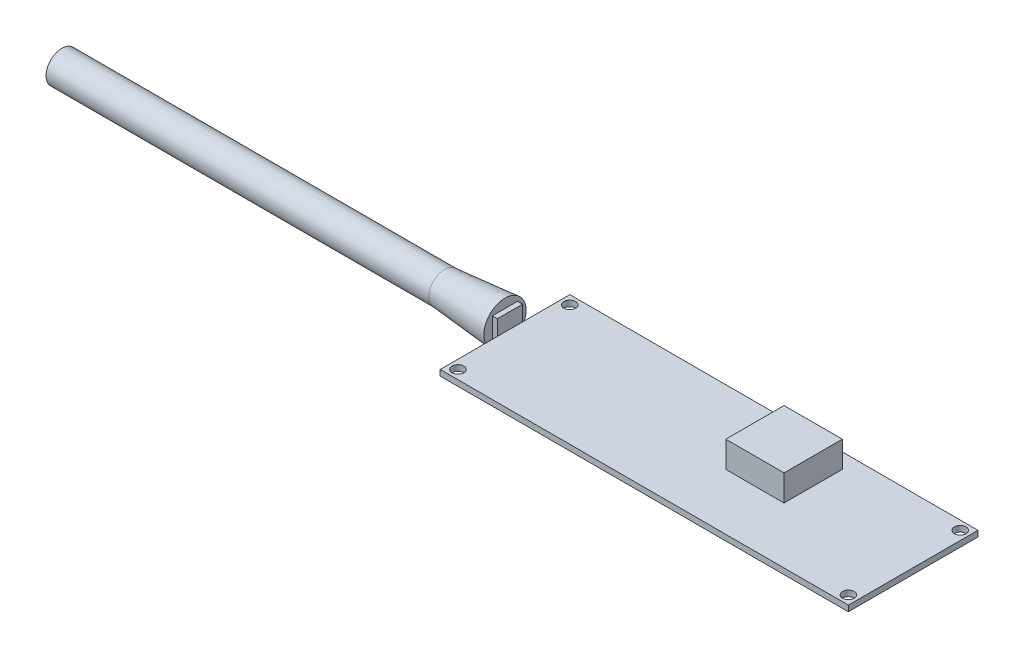
ISO-10303-21;
HEADER;
FILE_DESCRIPTION(('STEP AP214'),'2;1');
FILE_NAME('part.step','',(''),(''),'','','');
FILE_SCHEMA(('AUTOMOTIVE_DESIGN { 1 0 10303 214 1 1 1 1 }'));
ENDSEC;
DATA;
#1=APPLICATION_CONTEXT('core data for automotive mechanical design processes');
#2=APPLICATION_PROTOCOL_DEFINITION('international standard','automotive_design',2000,#1);
#3=PRODUCT_CONTEXT('',#1,'mechanical');
#4=PRODUCT('Part','Part','',(#3));
#5=PRODUCT_RELATED_PRODUCT_CATEGORY('part','',(#4));
#6=PRODUCT_DEFINITION_FORMATION('','',#4);
#7=PRODUCT_DEFINITION_CONTEXT('part definition',#1,'design');
#8=PRODUCT_DEFINITION('design','',#6,#7);
#9=PRODUCT_DEFINITION_SHAPE('','',#8);
#10=(LENGTH_UNIT() NAMED_UNIT(*) SI_UNIT(.MILLI.,.METRE.));
#11=(NAMED_UNIT(*) PLANE_ANGLE_UNIT() SI_UNIT($,.RADIAN.));
#12=(NAMED_UNIT(*) SI_UNIT($,.STERADIAN.) SOLID_ANGLE_UNIT());
#13=UNCERTAINTY_MEASURE_WITH_UNIT(LENGTH_MEASURE(1.E-05),#10,'distance_accuracy_value','');
#14=(GEOMETRIC_REPRESENTATION_CONTEXT(3) GLOBAL_UNCERTAINTY_ASSIGNED_CONTEXT((#13)) GLOBAL_UNIT_ASSIGNED_CONTEXT((#10,
#11,#12)) REPRESENTATION_CONTEXT('',''));
#15=CARTESIAN_POINT('',(0.,0.,0.));
#16=DIRECTION('',(0.,0.,1.));
#17=DIRECTION('',(1.,0.,0.));
#18=AXIS2_PLACEMENT_3D('',#15,#16,#17);
#19=CARTESIAN_POINT('',(-51.5874,1.4605,16.383));
#20=DIRECTION('',(1.,0.,0.));
#21=DIRECTION('',(0.,0.,-1.));
#22=AXIS2_PLACEMENT_3D('',#19,#20,#21);
#23=PLANE('',#22);
#24=DIRECTION('',(0.,1.,0.));
#25=VECTOR('',#24,1.);
#26=CARTESIAN_POINT('',(-51.5874,-0.762,1.905));
#27=LINE('',#26,#25);
#28=CARTESIAN_POINT('',(-51.5874,0.,1.905));
#29=VERTEX_POINT('',#28);
#30=CARTESIAN_POINT('',(-51.5874,1.4605,1.905));
#31=VERTEX_POINT('',#30);
#32=EDGE_CURVE('E11',#29,#31,#27,.T.);
#33=ORIENTED_EDGE('',*,*,#32,.F.);
#34=DIRECTION('',(0.,0.,1.));
#35=VECTOR('',#34,1.);
#36=CARTESIAN_POINT('',(-51.5874,0.,16.383));
#37=LINE('',#36,#35);
#38=CARTESIAN_POINT('',(-51.5874,0.,16.383));
#39=VERTEX_POINT('',#38);
#40=EDGE_CURVE('E262',#29,#39,#37,.T.);
#41=ORIENTED_EDGE('',*,*,#40,.T.);
#42=DIRECTION('',(0.,-1.,0.));
#43=VECTOR('',#42,1.);
#44=CARTESIAN_POINT('',(-51.5874,1.4605,16.383));
#45=LINE('',#44,#43);
#46=CARTESIAN_POINT('',(-51.5874,1.4605,16.383));
#47=VERTEX_POINT('',#46);
#48=EDGE_CURVE('E269',#47,#39,#45,.T.);
#49=ORIENTED_EDGE('',*,*,#48,.F.);
#50=DIRECTION('',(0.,0.,1.));
#51=VECTOR('',#50,1.);
#52=CARTESIAN_POINT('',(-51.5874,1.4605,16.383));
#53=LINE('',#52,#51);
#54=EDGE_CURVE('E59',#31,#47,#53,.T.);
#55=ORIENTED_EDGE('',*,*,#54,.F.);
#56=EDGE_LOOP('',(#33,#41,#49,#55));
#57=FACE_BOUND('',#56,.T.);
#58=ADVANCED_FACE('F38',(#57),#23,.F.);
#59=DIRECTION('',(0.,-1.,0.));
#60=VECTOR('',#59,1.);
#61=CARTESIAN_POINT('',(-51.5874,-0.762,-4.445));
#62=LINE('',#61,#60);
#63=CARTESIAN_POINT('',(-51.5874,1.4605,-4.445));
#64=VERTEX_POINT('',#63);
#65=CARTESIAN_POINT('',(-51.5874,0.,-4.445));
#66=VERTEX_POINT('',#65);
#67=EDGE_CURVE('E49',#64,#66,#62,.T.);
#68=ORIENTED_EDGE('',*,*,#67,.F.);
#69=CARTESIAN_POINT('',(-51.5874,1.4605,-16.383));
#70=VERTEX_POINT('',#69);
#71=EDGE_CURVE('E252',#70,#64,#53,.T.);
#72=ORIENTED_EDGE('',*,*,#71,.F.);
#73=DIRECTION('',(0.,-1.,0.));
#74=VECTOR('',#73,1.);
#75=CARTESIAN_POINT('',(-51.5874,1.4605,-16.383));
#76=LINE('',#75,#74);
#77=CARTESIAN_POINT('',(-51.5874,0.,-16.383));
#78=VERTEX_POINT('',#77);
#79=EDGE_CURVE('E272',#70,#78,#76,.T.);
#80=ORIENTED_EDGE('',*,*,#79,.T.);
#81=EDGE_CURVE('E263',#78,#66,#37,.T.);
#82=ORIENTED_EDGE('',*,*,#81,.T.);
#83=EDGE_LOOP('',(#68,#72,#80,#82));
#84=FACE_BOUND('',#83,.T.);
#85=ADVANCED_FACE('F342',(#84),#23,.F.);
#86=CARTESIAN_POINT('',(0.,1.4605,0.));
#87=DIRECTION('',(0.,-1.,0.));
#88=DIRECTION('',(0.,0.,-1.));
#89=AXIS2_PLACEMENT_3D('',#86,#87,#88);
#90=PLANE('',#89);
#91=DIRECTION('',(0.,0.,-1.));
#92=VECTOR('',#91,1.);
#93=CARTESIAN_POINT('',(51.5874,1.4605,16.383));
#94=LINE('',#93,#92);
#95=CARTESIAN_POINT('',(51.5874,1.4605,16.383));
#96=VERTEX_POINT('',#95);
#97=CARTESIAN_POINT('',(51.5874,1.4605,-16.383));
#98=VERTEX_POINT('',#97);
#99=EDGE_CURVE('E246',#96,#98,#94,.T.);
#100=ORIENTED_EDGE('',*,*,#99,.T.);
#101=DIRECTION('',(-1.,0.,0.));
#102=VECTOR('',#101,1.);
#103=CARTESIAN_POINT('',(-51.5874,1.4605,-16.383));
#104=LINE('',#103,#102);
#105=EDGE_CURVE('E249',#98,#70,#104,.T.);
#106=ORIENTED_EDGE('',*,*,#105,.T.);
#107=ORIENTED_EDGE('',*,*,#71,.T.);
#108=EDGE_CURVE('E255',#64,#31,#53,.T.);
#109=ORIENTED_EDGE('',*,*,#108,.T.);
#110=ORIENTED_EDGE('',*,*,#54,.T.);
#111=DIRECTION('',(1.,0.,0.));
#112=VECTOR('',#111,1.);
#113=CARTESIAN_POINT('',(-51.5874,1.4605,16.383));
#114=LINE('',#113,#112);
#115=EDGE_CURVE('E254',#47,#96,#114,.T.);
#116=ORIENTED_EDGE('',*,*,#115,.T.);
#117=EDGE_LOOP('',(#100,#106,#107,#109,#110,#116));
#118=FACE_BOUND('',#117,.T.);
#119=CARTESIAN_POINT('',(-49.3395,1.4605,-14.1351));
#120=DIRECTION('',(0.,1.,0.));
#121=DIRECTION('',(0.,0.,1.));
#122=AXIS2_PLACEMENT_3D('',#119,#120,#121);
#123=CIRCLE('',#122,1.4859);
#124=CARTESIAN_POINT('',(-49.3395,1.4605,-12.6492));
#125=VERTEX_POINT('',#124);
#126=EDGE_CURVE('E229',#125,#125,#123,.T.);
#127=ORIENTED_EDGE('',*,*,#126,.F.);
#128=EDGE_LOOP('',(#127));
#129=FACE_BOUND('',#128,.T.);
#130=CARTESIAN_POINT('',(49.3395,1.4605,-14.1351));
#131=DIRECTION('',(0.,1.,0.));
#132=DIRECTION('',(0.,0.,1.));
#133=AXIS2_PLACEMENT_3D('',#130,#131,#132);
#134=CIRCLE('',#133,1.4859);
#135=CARTESIAN_POINT('',(49.3395,1.4605,-12.6492));
#136=VERTEX_POINT('',#135);
#137=EDGE_CURVE('E222',#136,#136,#134,.T.);
#138=ORIENTED_EDGE('',*,*,#137,.F.);
#139=EDGE_LOOP('',(#138));
#140=FACE_BOUND('',#139,.T.);
#141=CARTESIAN_POINT('',(49.3395,1.4605,14.1351));
#142=DIRECTION('',(0.,1.,0.));
#143=DIRECTION('',(0.,0.,1.));
#144=AXIS2_PLACEMENT_3D('',#141,#142,#143);
#145=CIRCLE('',#144,1.4859);
#146=CARTESIAN_POINT('',(49.3395,1.4605,15.621));
#147=VERTEX_POINT('',#146);
#148=EDGE_CURVE('E230',#147,#147,#145,.T.);
#149=ORIENTED_EDGE('',*,*,#148,.F.);
#150=EDGE_LOOP('',(#149));
#151=FACE_BOUND('',#150,.T.);
#152=CARTESIAN_POINT('',(-49.3395,1.4605,14.1351));
#153=DIRECTION('',(0.,1.,0.));
#154=DIRECTION('',(0.,0.,1.));
#155=AXIS2_PLACEMENT_3D('',#152,#153,#154);
#156=CIRCLE('',#155,1.4859);
#157=CARTESIAN_POINT('',(-49.3395,1.4605,15.621));
#158=VERTEX_POINT('',#157);
#159=EDGE_CURVE('E221',#158,#158,#156,.T.);
#160=ORIENTED_EDGE('',*,*,#159,.F.);
#161=EDGE_LOOP('',(#160));
#162=FACE_BOUND('',#161,.T.);
#163=DIRECTION('',(0.,0.,-1.));
#164=VECTOR('',#163,1.);
#165=CARTESIAN_POINT('',(21.1074,1.4605,-12.573));
#166=LINE('',#165,#164);
#167=CARTESIAN_POINT('',(21.1074,1.4605,2.159));
#168=VERTEX_POINT('',#167);
#169=CARTESIAN_POINT('',(21.1074,1.4605,-12.573));
#170=VERTEX_POINT('',#169);
#171=EDGE_CURVE('E188',#168,#170,#166,.T.);
#172=ORIENTED_EDGE('',*,*,#171,.F.);
#173=DIRECTION('',(1.,0.,0.));
#174=VECTOR('',#173,1.);
#175=CARTESIAN_POINT('',(6.37540000000003,1.4605,2.159));
#176=LINE('',#175,#174);
#177=CARTESIAN_POINT('',(6.37540000000003,1.4605,2.159));
#178=VERTEX_POINT('',#177);
#179=EDGE_CURVE('E193',#178,#168,#176,.T.);
#180=ORIENTED_EDGE('',*,*,#179,.F.);
#181=DIRECTION('',(0.,0.,1.));
#182=VECTOR('',#181,1.);
#183=CARTESIAN_POINT('',(6.37540000000002,1.4605,-12.573));
#184=LINE('',#183,#182);
#185=CARTESIAN_POINT('',(6.37540000000002,1.4605,-12.573));
#186=VERTEX_POINT('',#185);
#187=EDGE_CURVE('E205',#186,#178,#184,.T.);
#188=ORIENTED_EDGE('',*,*,#187,.F.);
#189=DIRECTION('',(-1.,0.,0.));
#190=VECTOR('',#189,1.);
#191=CARTESIAN_POINT('',(6.37540000000002,1.4605,-12.573));
#192=LINE('',#191,#190);
#193=EDGE_CURVE('E202',#170,#186,#192,.T.);
#194=ORIENTED_EDGE('',*,*,#193,.F.);
#195=EDGE_LOOP('',(#172,#180,#188,#194));
#196=FACE_BOUND('',#195,.T.);
#197=ADVANCED_FACE('F322',(#118,#129,#140,#151,#162,#196),#90,.F.);
#198=CARTESIAN_POINT('',(51.5874,1.4605,16.383));
#199=DIRECTION('',(-1.,0.,0.));
#200=DIRECTION('',(0.,0.,1.));
#201=AXIS2_PLACEMENT_3D('',#198,#199,#200);
#202=PLANE('',#201);
#203=DIRECTION('',(0.,0.,-1.));
#204=VECTOR('',#203,1.);
#205=CARTESIAN_POINT('',(51.5874,0.,16.383));
#206=LINE('',#205,#204);
#207=CARTESIAN_POINT('',(51.5874,0.,16.383));
#208=VERTEX_POINT('',#207);
#209=CARTESIAN_POINT('',(51.5874,0.,-16.383));
#210=VERTEX_POINT('',#209);
#211=EDGE_CURVE('E245',#208,#210,#206,.T.);
#212=ORIENTED_EDGE('',*,*,#211,.T.);
#213=DIRECTION('',(0.,-1.,0.));
#214=VECTOR('',#213,1.);
#215=CARTESIAN_POINT('',(51.5874,1.4605,-16.383));
#216=LINE('',#215,#214);
#217=EDGE_CURVE('E275',#98,#210,#216,.T.);
#218=ORIENTED_EDGE('',*,*,#217,.F.);
#219=ORIENTED_EDGE('',*,*,#99,.F.);
#220=DIRECTION('',(0.,-1.,0.));
#221=VECTOR('',#220,1.);
#222=CARTESIAN_POINT('',(51.5874,1.4605,16.383));
#223=LINE('',#222,#221);
#224=EDGE_CURVE('E257',#96,#208,#223,.T.);
#225=ORIENTED_EDGE('',*,*,#224,.T.);
#226=EDGE_LOOP('',(#212,#218,#219,#225));
#227=FACE_BOUND('',#226,.T.);
#228=ADVANCED_FACE('F40',(#227),#202,.F.);
#229=CARTESIAN_POINT('',(-51.5874,1.4605,-16.383));
#230=DIRECTION('',(0.,0.,1.));
#231=DIRECTION('',(1.,0.,0.));
#232=AXIS2_PLACEMENT_3D('',#229,#230,#231);
#233=PLANE('',#232);
#234=DIRECTION('',(-1.,0.,0.));
#235=VECTOR('',#234,1.);
#236=CARTESIAN_POINT('',(-51.5874,0.,-16.383));
#237=LINE('',#236,#235);
#238=EDGE_CURVE('E260',#210,#78,#237,.T.);
#239=ORIENTED_EDGE('',*,*,#238,.T.);
#240=ORIENTED_EDGE('',*,*,#79,.F.);
#241=ORIENTED_EDGE('',*,*,#105,.F.);
#242=ORIENTED_EDGE('',*,*,#217,.T.);
#243=EDGE_LOOP('',(#239,#240,#241,#242));
#244=FACE_BOUND('',#243,.T.);
#245=ADVANCED_FACE('F349',(#244),#233,.F.);
#246=CARTESIAN_POINT('',(-51.5874,1.4605,16.383));
#247=DIRECTION('',(0.,0.,-1.));
#248=DIRECTION('',(-1.,0.,0.));
#249=AXIS2_PLACEMENT_3D('',#246,#247,#248);
#250=PLANE('',#249);
#251=DIRECTION('',(1.,0.,0.));
#252=VECTOR('',#251,1.);
#253=CARTESIAN_POINT('',(-51.5874,0.,16.383));
#254=LINE('',#253,#252);
#255=EDGE_CURVE('E250',#39,#208,#254,.T.);
#256=ORIENTED_EDGE('',*,*,#255,.T.);
#257=ORIENTED_EDGE('',*,*,#224,.F.);
#258=ORIENTED_EDGE('',*,*,#115,.F.);
#259=ORIENTED_EDGE('',*,*,#48,.T.);
#260=EDGE_LOOP('',(#256,#257,#258,#259));
#261=FACE_BOUND('',#260,.T.);
#262=ADVANCED_FACE('F316',(#261),#250,.F.);
#263=CARTESIAN_POINT('',(0.,0.,0.));
#264=DIRECTION('',(0.,-1.,0.));
#265=DIRECTION('',(0.,0.,-1.));
#266=AXIS2_PLACEMENT_3D('',#263,#264,#265);
#267=PLANE('',#266);
#268=CARTESIAN_POINT('',(-49.3395,0.,14.1351));
#269=DIRECTION('',(0.,-1.,0.));
#270=DIRECTION('',(0.,0.,-1.));
#271=AXIS2_PLACEMENT_3D('',#268,#269,#270);
#272=CIRCLE('',#271,1.4859);
#273=CARTESIAN_POINT('',(-49.3395,0.,12.6492));
#274=VERTEX_POINT('',#273);
#275=EDGE_CURVE('E233',#274,#274,#272,.F.);
#276=ORIENTED_EDGE('',*,*,#275,.T.);
#277=EDGE_LOOP('',(#276));
#278=FACE_BOUND('',#277,.T.);
#279=CARTESIAN_POINT('',(49.3395,0.,14.1351));
#280=DIRECTION('',(0.,-1.,0.));
#281=DIRECTION('',(0.,0.,-1.));
#282=AXIS2_PLACEMENT_3D('',#279,#280,#281);
#283=CIRCLE('',#282,1.4859);
#284=CARTESIAN_POINT('',(49.3395,0.,12.6492));
#285=VERTEX_POINT('',#284);
#286=EDGE_CURVE('E226',#285,#285,#283,.F.);
#287=ORIENTED_EDGE('',*,*,#286,.T.);
#288=EDGE_LOOP('',(#287));
#289=FACE_BOUND('',#288,.T.);
#290=CARTESIAN_POINT('',(49.3395,0.,-14.1351));
#291=DIRECTION('',(0.,-1.,0.));
#292=DIRECTION('',(0.,0.,-1.));
#293=AXIS2_PLACEMENT_3D('',#290,#291,#292);
#294=CIRCLE('',#293,1.4859);
#295=CARTESIAN_POINT('',(49.3395,0.,-15.621));
#296=VERTEX_POINT('',#295);
#297=EDGE_CURVE('E225',#296,#296,#294,.F.);
#298=ORIENTED_EDGE('',*,*,#297,.T.);
#299=EDGE_LOOP('',(#298));
#300=FACE_BOUND('',#299,.T.);
#301=CARTESIAN_POINT('',(-49.3395,0.,-14.1351));
#302=DIRECTION('',(0.,-1.,0.));
#303=DIRECTION('',(0.,0.,-1.));
#304=AXIS2_PLACEMENT_3D('',#301,#302,#303);
#305=CIRCLE('',#304,1.4859);
#306=CARTESIAN_POINT('',(-49.3395,0.,-15.621));
#307=VERTEX_POINT('',#306);
#308=EDGE_CURVE('E242',#307,#307,#305,.F.);
#309=ORIENTED_EDGE('',*,*,#308,.T.);
#310=EDGE_LOOP('',(#309));
#311=FACE_BOUND('',#310,.T.);
#312=ORIENTED_EDGE('',*,*,#211,.F.);
#313=ORIENTED_EDGE('',*,*,#255,.F.);
#314=ORIENTED_EDGE('',*,*,#40,.F.);
#315=EDGE_CURVE('E265',#66,#29,#37,.T.);
#316=ORIENTED_EDGE('',*,*,#315,.F.);
#317=ORIENTED_EDGE('',*,*,#81,.F.);
#318=ORIENTED_EDGE('',*,*,#238,.F.);
#319=EDGE_LOOP('',(#312,#313,#314,#316,#317,#318));
#320=FACE_BOUND('',#319,.T.);
#321=ADVANCED_FACE('F312',(#278,#289,#300,#311,#320),#267,.T.);
#322=CARTESIAN_POINT('',(-49.3395,-4.20275986466036,-14.1351));
#323=DIRECTION('',(0.,1.,0.));
#324=DIRECTION('',(0.,0.,1.));
#325=AXIS2_PLACEMENT_3D('',#322,#323,#324);
#326=CYLINDRICAL_SURFACE('',#325,1.4859);
#327=ORIENTED_EDGE('',*,*,#126,.T.);
#328=EDGE_LOOP('',(#327));
#329=FACE_BOUND('',#328,.T.);
#330=ORIENTED_EDGE('',*,*,#308,.F.);
#331=EDGE_LOOP('',(#330));
#332=FACE_BOUND('',#331,.T.);
#333=ADVANCED_FACE('F363',(#329,#332),#326,.F.);
#334=CARTESIAN_POINT('',(49.3395,-4.20275986466036,-14.1351));
#335=DIRECTION('',(0.,1.,0.));
#336=DIRECTION('',(0.,0.,1.));
#337=AXIS2_PLACEMENT_3D('',#334,#335,#336);
#338=CYLINDRICAL_SURFACE('',#337,1.4859);
#339=ORIENTED_EDGE('',*,*,#137,.T.);
#340=EDGE_LOOP('',(#339));
#341=FACE_BOUND('',#340,.T.);
#342=ORIENTED_EDGE('',*,*,#297,.F.);
#343=EDGE_LOOP('',(#342));
#344=FACE_BOUND('',#343,.T.);
#345=ADVANCED_FACE('F370',(#341,#344),#338,.F.);
#346=CARTESIAN_POINT('',(49.3395,-4.20275986466036,14.1351));
#347=DIRECTION('',(0.,1.,0.));
#348=DIRECTION('',(0.,0.,1.));
#349=AXIS2_PLACEMENT_3D('',#346,#347,#348);
#350=CYLINDRICAL_SURFACE('',#349,1.4859);
#351=ORIENTED_EDGE('',*,*,#148,.T.);
#352=EDGE_LOOP('',(#351));
#353=FACE_BOUND('',#352,.T.);
#354=ORIENTED_EDGE('',*,*,#286,.F.);
#355=EDGE_LOOP('',(#354));
#356=FACE_BOUND('',#355,.T.);
#357=ADVANCED_FACE('F382',(#353,#356),#350,.F.);
#358=CARTESIAN_POINT('',(-49.3395,-4.20275986466036,14.1351));
#359=DIRECTION('',(0.,1.,0.));
#360=DIRECTION('',(0.,0.,1.));
#361=AXIS2_PLACEMENT_3D('',#358,#359,#360);
#362=CYLINDRICAL_SURFACE('',#361,1.4859);
#363=ORIENTED_EDGE('',*,*,#159,.T.);
#364=EDGE_LOOP('',(#363));
#365=FACE_BOUND('',#364,.T.);
#366=ORIENTED_EDGE('',*,*,#275,.F.);
#367=EDGE_LOOP('',(#366));
#368=FACE_BOUND('',#367,.T.);
#369=ADVANCED_FACE('F388',(#365,#368),#362,.F.);
#370=CARTESIAN_POINT('',(21.1074,8.0645,-12.573));
#371=DIRECTION('',(-1.,0.,0.));
#372=DIRECTION('',(0.,0.,1.));
#373=AXIS2_PLACEMENT_3D('',#370,#371,#372);
#374=PLANE('',#373);
#375=ORIENTED_EDGE('',*,*,#171,.T.);
#376=DIRECTION('',(0.,-1.,0.));
#377=VECTOR('',#376,1.);
#378=CARTESIAN_POINT('',(21.1074,8.0645,-12.573));
#379=LINE('',#378,#377);
#380=CARTESIAN_POINT('',(21.1074,8.0645,-12.573));
#381=VERTEX_POINT('',#380);
#382=EDGE_CURVE('E218',#381,#170,#379,.T.);
#383=ORIENTED_EDGE('',*,*,#382,.F.);
#384=DIRECTION('',(0.,0.,-1.));
#385=VECTOR('',#384,1.);
#386=CARTESIAN_POINT('',(21.1074,8.0645,-12.573));
#387=LINE('',#386,#385);
#388=CARTESIAN_POINT('',(21.1074,8.0645,2.159));
#389=VERTEX_POINT('',#388);
#390=EDGE_CURVE('E189',#389,#381,#387,.T.);
#391=ORIENTED_EDGE('',*,*,#390,.F.);
#392=DIRECTION('',(0.,-1.,0.));
#393=VECTOR('',#392,1.);
#394=CARTESIAN_POINT('',(21.1074,8.0645,2.159));
#395=LINE('',#394,#393);
#396=EDGE_CURVE('E199',#389,#168,#395,.T.);
#397=ORIENTED_EDGE('',*,*,#396,.T.);
#398=EDGE_LOOP('',(#375,#383,#391,#397));
#399=FACE_BOUND('',#398,.T.);
#400=ADVANCED_FACE('F392',(#399),#374,.F.);
#401=CARTESIAN_POINT('',(6.37540000000002,8.0645,-12.573));
#402=DIRECTION('',(0.,0.,1.));
#403=DIRECTION('',(1.,0.,0.));
#404=AXIS2_PLACEMENT_3D('',#401,#402,#403);
#405=PLANE('',#404);
#406=ORIENTED_EDGE('',*,*,#193,.T.);
#407=DIRECTION('',(0.,-1.,0.));
#408=VECTOR('',#407,1.);
#409=CARTESIAN_POINT('',(6.37540000000002,8.0645,-12.573));
#410=LINE('',#409,#408);
#411=CARTESIAN_POINT('',(6.37540000000002,8.0645,-12.573));
#412=VERTEX_POINT('',#411);
#413=EDGE_CURVE('E215',#412,#186,#410,.T.);
#414=ORIENTED_EDGE('',*,*,#413,.F.);
#415=DIRECTION('',(-1.,0.,0.));
#416=VECTOR('',#415,1.);
#417=CARTESIAN_POINT('',(6.37540000000002,8.0645,-12.573));
#418=LINE('',#417,#416);
#419=EDGE_CURVE('E192',#381,#412,#418,.T.);
#420=ORIENTED_EDGE('',*,*,#419,.F.);
#421=ORIENTED_EDGE('',*,*,#382,.T.);
#422=EDGE_LOOP('',(#406,#414,#420,#421));
#423=FACE_BOUND('',#422,.T.);
#424=ADVANCED_FACE('F399',(#423),#405,.F.);
#425=CARTESIAN_POINT('',(6.37540000000002,8.0645,-12.573));
#426=DIRECTION('',(1.,0.,0.));
#427=DIRECTION('',(0.,0.,-1.));
#428=AXIS2_PLACEMENT_3D('',#425,#426,#427);
#429=PLANE('',#428);
#430=ORIENTED_EDGE('',*,*,#187,.T.);
#431=DIRECTION('',(0.,-1.,0.));
#432=VECTOR('',#431,1.);
#433=CARTESIAN_POINT('',(6.37540000000003,8.0645,2.159));
#434=LINE('',#433,#432);
#435=CARTESIAN_POINT('',(6.37540000000003,8.0645,2.159));
#436=VERTEX_POINT('',#435);
#437=EDGE_CURVE('E212',#436,#178,#434,.T.);
#438=ORIENTED_EDGE('',*,*,#437,.F.);
#439=DIRECTION('',(0.,0.,1.));
#440=VECTOR('',#439,1.);
#441=CARTESIAN_POINT('',(6.37540000000002,8.0645,-12.573));
#442=LINE('',#441,#440);
#443=EDGE_CURVE('E195',#412,#436,#442,.T.);
#444=ORIENTED_EDGE('',*,*,#443,.F.);
#445=ORIENTED_EDGE('',*,*,#413,.T.);
#446=EDGE_LOOP('',(#430,#438,#444,#445));
#447=FACE_BOUND('',#446,.T.);
#448=ADVANCED_FACE('F414',(#447),#429,.F.);
#449=CARTESIAN_POINT('',(6.37540000000003,8.0645,2.159));
#450=DIRECTION('',(0.,0.,-1.));
#451=DIRECTION('',(-1.,0.,0.));
#452=AXIS2_PLACEMENT_3D('',#449,#450,#451);
#453=PLANE('',#452);
#454=ORIENTED_EDGE('',*,*,#179,.T.);
#455=ORIENTED_EDGE('',*,*,#396,.F.);
#456=DIRECTION('',(1.,0.,0.));
#457=VECTOR('',#456,1.);
#458=CARTESIAN_POINT('',(6.37540000000003,8.0645,2.159));
#459=LINE('',#458,#457);
#460=EDGE_CURVE('E197',#436,#389,#459,.T.);
#461=ORIENTED_EDGE('',*,*,#460,.F.);
#462=ORIENTED_EDGE('',*,*,#437,.T.);
#463=EDGE_LOOP('',(#454,#455,#461,#462));
#464=FACE_BOUND('',#463,.T.);
#465=ADVANCED_FACE('F336',(#464),#453,.F.);
#466=CARTESIAN_POINT('',(0.,8.0645,0.));
#467=DIRECTION('',(0.,1.,0.));
#468=DIRECTION('',(0.,0.,1.));
#469=AXIS2_PLACEMENT_3D('',#466,#467,#468);
#470=PLANE('',#469);
#471=ORIENTED_EDGE('',*,*,#390,.T.);
#472=ORIENTED_EDGE('',*,*,#419,.T.);
#473=ORIENTED_EDGE('',*,*,#443,.T.);
#474=ORIENTED_EDGE('',*,*,#460,.T.);
#475=EDGE_LOOP('',(#471,#472,#473,#474));
#476=FACE_BOUND('',#475,.T.);
#477=ADVANCED_FACE('F329',(#476),#470,.T.);
#478=CARTESIAN_POINT('',(-51.5874,0.,0.));
#479=DIRECTION('',(1.,0.,0.));
#480=DIRECTION('',(0.,0.,-1.));
#481=AXIS2_PLACEMENT_3D('',#478,#479,#480);
#482=PLANE('',#481);
#483=ORIENTED_EDGE('',*,*,#108,.F.);
#484=CARTESIAN_POINT('',(-51.5874,5.334,-4.445));
#485=VERTEX_POINT('',#484);
#486=EDGE_CURVE('E179',#485,#64,#62,.T.);
#487=ORIENTED_EDGE('',*,*,#486,.F.);
#488=DIRECTION('',(0.,0.,-1.));
#489=VECTOR('',#488,1.);
#490=CARTESIAN_POINT('',(-51.5874,5.334,-4.445));
#491=LINE('',#490,#489);
#492=CARTESIAN_POINT('',(-51.5874,5.334,1.905));
#493=VERTEX_POINT('',#492);
#494=EDGE_CURVE('E176',#493,#485,#491,.T.);
#495=ORIENTED_EDGE('',*,*,#494,.F.);
#496=EDGE_CURVE('E52',#31,#493,#27,.T.);
#497=ORIENTED_EDGE('',*,*,#496,.F.);
#498=EDGE_LOOP('',(#483,#487,#495,#497));
#499=FACE_BOUND('',#498,.T.);
#500=ADVANCED_FACE('F327',(#499),#482,.T.);
#501=CARTESIAN_POINT('',(-52.8574,-0.762,1.905));
#502=DIRECTION('',(0.,0.,-1.));
#503=DIRECTION('',(-1.,0.,0.));
#504=AXIS2_PLACEMENT_3D('',#501,#502,#503);
#505=PLANE('',#504);
#506=CARTESIAN_POINT('',(-51.5874,-0.762,1.905));
#507=VERTEX_POINT('',#506);
#508=EDGE_CURVE('E51',#507,#29,#27,.T.);
#509=ORIENTED_EDGE('',*,*,#508,.T.);
#510=ORIENTED_EDGE('',*,*,#32,.T.);
#511=ORIENTED_EDGE('',*,*,#496,.T.);
#512=DIRECTION('',(1.,0.,0.));
#513=VECTOR('',#512,1.);
#514=CARTESIAN_POINT('',(-52.8574,5.334,1.905));
#515=LINE('',#514,#513);
#516=CARTESIAN_POINT('',(-52.8574,5.334,1.905));
#517=VERTEX_POINT('',#516);
#518=EDGE_CURVE('E153',#517,#493,#515,.T.);
#519=ORIENTED_EDGE('',*,*,#518,.F.);
#520=DIRECTION('',(0.,1.,0.));
#521=VECTOR('',#520,1.);
#522=CARTESIAN_POINT('',(-52.8574,-0.762,1.905));
#523=LINE('',#522,#521);
#524=CARTESIAN_POINT('',(-52.8574,-0.762,1.905));
#525=VERTEX_POINT('',#524);
#526=EDGE_CURVE('E146',#525,#517,#523,.T.);
#527=ORIENTED_EDGE('',*,*,#526,.F.);
#528=DIRECTION('',(1.,0.,0.));
#529=VECTOR('',#528,1.);
#530=CARTESIAN_POINT('',(-52.8574,-0.762,1.905));
#531=LINE('',#530,#529);
#532=EDGE_CURVE('E150',#525,#507,#531,.T.);
#533=ORIENTED_EDGE('',*,*,#532,.T.);
#534=EDGE_LOOP('',(#509,#510,#511,#519,#527,#533));
#535=FACE_BOUND('',#534,.T.);
#536=ADVANCED_FACE('F149',(#535),#505,.F.);
#537=CARTESIAN_POINT('',(-52.8574,5.334,-4.445));
#538=DIRECTION('',(0.,-1.,0.));
#539=DIRECTION('',(0.,0.,-1.));
#540=AXIS2_PLACEMENT_3D('',#537,#538,#539);
#541=PLANE('',#540);
#542=ORIENTED_EDGE('',*,*,#494,.T.);
#543=DIRECTION('',(1.,0.,0.));
#544=VECTOR('',#543,1.);
#545=CARTESIAN_POINT('',(-52.8574,5.334,-4.445));
#546=LINE('',#545,#544);
#547=CARTESIAN_POINT('',(-52.8574,5.334,-4.445));
#548=VERTEX_POINT('',#547);
#549=EDGE_CURVE('E184',#548,#485,#546,.T.);
#550=ORIENTED_EDGE('',*,*,#549,.F.);
#551=DIRECTION('',(0.,0.,-1.));
#552=VECTOR('',#551,1.);
#553=CARTESIAN_POINT('',(-52.8574,5.334,-4.445));
#554=LINE('',#553,#552);
#555=EDGE_CURVE('E157',#517,#548,#554,.T.);
#556=ORIENTED_EDGE('',*,*,#555,.F.);
#557=ORIENTED_EDGE('',*,*,#518,.T.);
#558=EDGE_LOOP('',(#542,#550,#556,#557));
#559=FACE_BOUND('',#558,.T.);
#560=ADVANCED_FACE('F297',(#559),#541,.F.);
#561=CARTESIAN_POINT('',(-52.8574,-0.762,-4.445));
#562=DIRECTION('',(0.,0.,1.));
#563=DIRECTION('',(1.,0.,0.));
#564=AXIS2_PLACEMENT_3D('',#561,#562,#563);
#565=PLANE('',#564);
#566=ORIENTED_EDGE('',*,*,#486,.T.);
#567=ORIENTED_EDGE('',*,*,#67,.T.);
#568=CARTESIAN_POINT('',(-51.5874,-0.762,-4.445));
#569=VERTEX_POINT('',#568);
#570=EDGE_CURVE('E178',#66,#569,#62,.T.);
#571=ORIENTED_EDGE('',*,*,#570,.T.);
#572=DIRECTION('',(1.,0.,0.));
#573=VECTOR('',#572,1.);
#574=CARTESIAN_POINT('',(-52.8574,-0.762,-4.445));
#575=LINE('',#574,#573);
#576=CARTESIAN_POINT('',(-52.8574,-0.762,-4.445));
#577=VERTEX_POINT('',#576);
#578=EDGE_CURVE('E167',#577,#569,#575,.T.);
#579=ORIENTED_EDGE('',*,*,#578,.F.);
#580=DIRECTION('',(0.,-1.,0.));
#581=VECTOR('',#580,1.);
#582=CARTESIAN_POINT('',(-52.8574,-0.762,-4.445));
#583=LINE('',#582,#581);
#584=EDGE_CURVE('E171',#548,#577,#583,.T.);
#585=ORIENTED_EDGE('',*,*,#584,.F.);
#586=ORIENTED_EDGE('',*,*,#549,.T.);
#587=EDGE_LOOP('',(#566,#567,#571,#579,#585,#586));
#588=FACE_BOUND('',#587,.T.);
#589=ADVANCED_FACE('F301',(#588),#565,.F.);
#590=CARTESIAN_POINT('',(-52.8574,-0.762,-4.445));
#591=DIRECTION('',(0.,1.,0.));
#592=DIRECTION('',(0.,0.,1.));
#593=AXIS2_PLACEMENT_3D('',#590,#591,#592);
#594=PLANE('',#593);
#595=DIRECTION('',(0.,0.,1.));
#596=VECTOR('',#595,1.);
#597=CARTESIAN_POINT('',(-51.5874,-0.762,-4.445));
#598=LINE('',#597,#596);
#599=EDGE_CURVE('E158',#569,#507,#598,.T.);
#600=ORIENTED_EDGE('',*,*,#599,.T.);
#601=ORIENTED_EDGE('',*,*,#532,.F.);
#602=DIRECTION('',(0.,0.,1.));
#603=VECTOR('',#602,1.);
#604=CARTESIAN_POINT('',(-52.8574,-0.762,-4.445));
#605=LINE('',#604,#603);
#606=EDGE_CURVE('E164',#577,#525,#605,.T.);
#607=ORIENTED_EDGE('',*,*,#606,.F.);
#608=ORIENTED_EDGE('',*,*,#578,.T.);
#609=EDGE_LOOP('',(#600,#601,#607,#608));
#610=FACE_BOUND('',#609,.T.);
#611=ADVANCED_FACE('F162',(#610),#594,.F.);
#612=ORIENTED_EDGE('',*,*,#570,.F.);
#613=ORIENTED_EDGE('',*,*,#315,.T.);
#614=ORIENTED_EDGE('',*,*,#508,.F.);
#615=ORIENTED_EDGE('',*,*,#599,.F.);
#616=EDGE_LOOP('',(#612,#613,#614,#615));
#617=FACE_BOUND('',#616,.T.);
#618=ADVANCED_FACE('F304',(#617),#482,.T.);
#619=CARTESIAN_POINT('',(-52.8574,2.286,-1.27));
#620=DIRECTION('',(-1.,0.,0.));
#621=DIRECTION('',(0.,0.,1.));
#622=AXIS2_PLACEMENT_3D('',#619,#620,#621);
#623=PLANE('',#622);
#624=CARTESIAN_POINT('',(-52.8574,2.286,-1.27));
#625=DIRECTION('',(-1.,0.,0.));
#626=DIRECTION('',(0.,0.,1.));
#627=AXIS2_PLACEMENT_3D('',#624,#625,#626);
#628=CIRCLE('',#627,5.334);
#629=CARTESIAN_POINT('',(-52.8574,2.286,4.064));
#630=VERTEX_POINT('',#629);
#631=EDGE_CURVE('E285',#630,#630,#628,.T.);
#632=ORIENTED_EDGE('',*,*,#631,.F.);
#633=EDGE_LOOP('',(#632));
#634=FACE_BOUND('',#633,.T.);
#635=ORIENTED_EDGE('',*,*,#606,.T.);
#636=ORIENTED_EDGE('',*,*,#526,.T.);
#637=ORIENTED_EDGE('',*,*,#555,.T.);
#638=ORIENTED_EDGE('',*,*,#584,.T.);
#639=EDGE_LOOP('',(#635,#636,#637,#638));
#640=FACE_BOUND('',#639,.T.);
#641=ADVANCED_FACE('F169',(#634,#640),#623,.F.);
#642=CARTESIAN_POINT('',(-52.8574,2.286,-1.27));
#643=DIRECTION('',(1.,0.,0.));
#644=DIRECTION('',(0.,0.,1.));
#645=AXIS2_PLACEMENT_3D('',#642,#643,#644);
#646=CONICAL_SURFACE('',#645,5.334,0.0872664625997165);
#647=CARTESIAN_POINT('',(-68.0974,2.286,-1.27));
#648=DIRECTION('',(-1.,0.,0.));
#649=DIRECTION('',(0.,0.,1.));
#650=AXIS2_PLACEMENT_3D('',#647,#648,#649);
#651=CIRCLE('',#650,4.0005);
#652=CARTESIAN_POINT('',(-68.0974,2.286,2.7305));
#653=VERTEX_POINT('',#652);
#654=EDGE_CURVE('E280',#653,#653,#651,.T.);
#655=ORIENTED_EDGE('',*,*,#654,.F.);
#656=EDGE_LOOP('',(#655));
#657=FACE_BOUND('',#656,.T.);
#658=ORIENTED_EDGE('',*,*,#631,.T.);
#659=EDGE_LOOP('',(#658));
#660=FACE_BOUND('',#659,.T.);
#661=ADVANCED_FACE('F281',(#657,#660),#646,.T.);
#662=CARTESIAN_POINT('',(-164.8714,2.286,-1.27));
#663=DIRECTION('',(1.,0.,0.));
#664=DIRECTION('',(0.,0.,-1.));
#665=AXIS2_PLACEMENT_3D('',#662,#663,#664);
#666=CYLINDRICAL_SURFACE('',#665,4.0005);
#667=CARTESIAN_POINT('',(-164.8714,2.286,-1.27));
#668=DIRECTION('',(-1.,0.,0.));
#669=DIRECTION('',(0.,0.,1.));
#670=AXIS2_PLACEMENT_3D('',#667,#668,#669);
#671=CIRCLE('',#670,4.0005);
#672=CARTESIAN_POINT('',(-164.8714,2.286,2.7305));
#673=VERTEX_POINT('',#672);
#674=EDGE_CURVE('E287',#673,#673,#671,.T.);
#675=ORIENTED_EDGE('',*,*,#674,.F.);
#676=EDGE_LOOP('',(#675));
#677=FACE_BOUND('',#676,.T.);
#678=ORIENTED_EDGE('',*,*,#654,.T.);
#679=EDGE_LOOP('',(#678));
#680=FACE_BOUND('',#679,.T.);
#681=ADVANCED_FACE('F450',(#677,#680),#666,.T.);
#682=CARTESIAN_POINT('',(-164.8714,2.286,-1.27));
#683=DIRECTION('',(-1.,0.,0.));
#684=DIRECTION('',(0.,0.,1.));
#685=AXIS2_PLACEMENT_3D('',#682,#683,#684);
#686=PLANE('',#685);
#687=ORIENTED_EDGE('',*,*,#674,.T.);
#688=EDGE_LOOP('',(#687));
#689=FACE_BOUND('',#688,.T.);
#690=ADVANCED_FACE('F456',(#689),#686,.T.);
#691=CLOSED_SHELL('',(#58,#85,#197,#228,#245,#262,#321,#333,#345,#357,#369,#400,#424,#448,#465,
#477,#500,#536,#560,#589,#611,#618,#641,#661,#681,#690));
#692=MANIFOLD_SOLID_BREP('B2',#691);
#693=ADVANCED_BREP_SHAPE_REPRESENTATION('',(#18,#692),#14);
#694=SHAPE_DEFINITION_REPRESENTATION(#9,#693);
ENDSEC;
END-ISO-10303-21;
